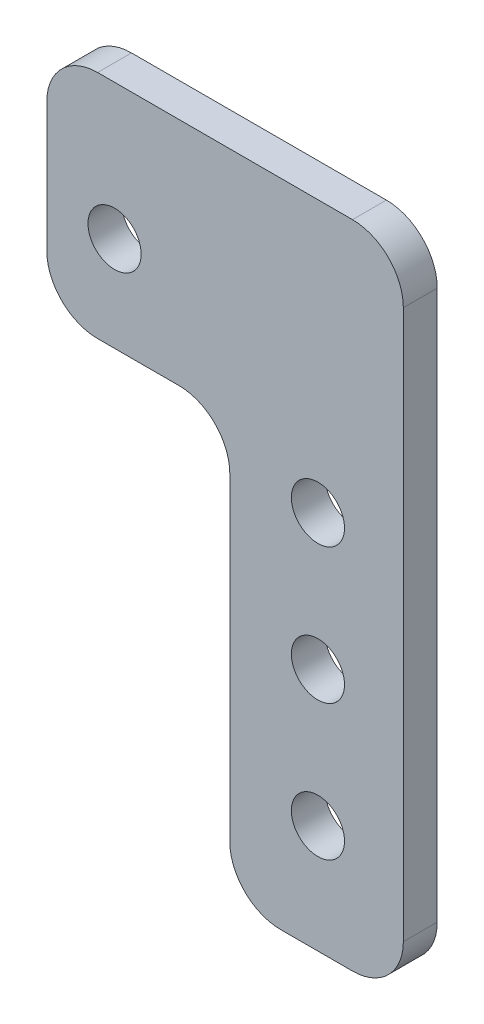
ISO-10303-21;
HEADER;
FILE_DESCRIPTION(('STEP AP214'),'2;1');
FILE_NAME('part.step','',(''),(''),'','','');
FILE_SCHEMA(('AUTOMOTIVE_DESIGN { 1 0 10303 214 1 1 1 1 }'));
ENDSEC;
DATA;
#1=APPLICATION_CONTEXT('core data for automotive mechanical design processes');
#2=APPLICATION_PROTOCOL_DEFINITION('international standard','automotive_design',2000,#1);
#3=PRODUCT_CONTEXT('',#1,'mechanical');
#4=PRODUCT('Part','Part','',(#3));
#5=PRODUCT_RELATED_PRODUCT_CATEGORY('part','',(#4));
#6=PRODUCT_DEFINITION_FORMATION('','',#4);
#7=PRODUCT_DEFINITION_CONTEXT('part definition',#1,'design');
#8=PRODUCT_DEFINITION('design','',#6,#7);
#9=PRODUCT_DEFINITION_SHAPE('','',#8);
#10=(LENGTH_UNIT() NAMED_UNIT(*) SI_UNIT(.MILLI.,.METRE.));
#11=(NAMED_UNIT(*) PLANE_ANGLE_UNIT() SI_UNIT($,.RADIAN.));
#12=(NAMED_UNIT(*) SI_UNIT($,.STERADIAN.) SOLID_ANGLE_UNIT());
#13=UNCERTAINTY_MEASURE_WITH_UNIT(LENGTH_MEASURE(1.E-05),#10,'distance_accuracy_value','');
#14=(GEOMETRIC_REPRESENTATION_CONTEXT(3) GLOBAL_UNCERTAINTY_ASSIGNED_CONTEXT((#13)) GLOBAL_UNIT_ASSIGNED_CONTEXT((#10,
#11,#12)) REPRESENTATION_CONTEXT('',''));
#15=CARTESIAN_POINT('',(0.,0.,0.));
#16=DIRECTION('',(0.,0.,1.));
#17=DIRECTION('',(1.,0.,0.));
#18=AXIS2_PLACEMENT_3D('',#15,#16,#17);
#19=CARTESIAN_POINT('',(0.,0.,3.175));
#20=DIRECTION('',(0.,0.,-1.));
#21=DIRECTION('',(-1.,0.,0.));
#22=AXIS2_PLACEMENT_3D('',#19,#20,#21);
#23=PLANE('',#22);
#24=DIRECTION('',(1.,0.,0.));
#25=VECTOR('',#24,1.);
#26=CARTESIAN_POINT('',(61.976,-63.5,3.175));
#27=LINE('',#26,#25);
#28=CARTESIAN_POINT('',(50.4825,-63.5,3.175));
#29=VERTEX_POINT('',#28);
#30=CARTESIAN_POINT('',(57.2135,-63.5,3.175));
#31=VERTEX_POINT('',#30);
#32=EDGE_CURVE('E161',#29,#31,#27,.T.);
#33=ORIENTED_EDGE('',*,*,#32,.T.);
#34=CARTESIAN_POINT('',(57.2135,-58.7375,3.175));
#35=DIRECTION('',(0.,0.,-1.));
#36=DIRECTION('',(-1.,0.,0.));
#37=AXIS2_PLACEMENT_3D('',#34,#35,#36);
#38=CIRCLE('',#37,4.7625);
#39=CARTESIAN_POINT('',(61.976,-58.7375,3.175));
#40=VERTEX_POINT('',#39);
#41=EDGE_CURVE('E191',#31,#40,#38,.F.);
#42=ORIENTED_EDGE('',*,*,#41,.T.);
#43=DIRECTION('',(0.,1.,0.));
#44=VECTOR('',#43,1.);
#45=CARTESIAN_POINT('',(61.976,-2.54,3.175));
#46=LINE('',#45,#44);
#47=CARTESIAN_POINT('',(61.976,-7.3025,3.175));
#48=VERTEX_POINT('',#47);
#49=EDGE_CURVE('E144',#40,#48,#46,.T.);
#50=ORIENTED_EDGE('',*,*,#49,.T.);
#51=CARTESIAN_POINT('',(57.2135,-7.3025,3.175));
#52=DIRECTION('',(0.,0.,-1.));
#53=DIRECTION('',(-1.,0.,0.));
#54=AXIS2_PLACEMENT_3D('',#51,#52,#53);
#55=CIRCLE('',#54,4.7625);
#56=CARTESIAN_POINT('',(57.2135,-2.54,3.175));
#57=VERTEX_POINT('',#56);
#58=EDGE_CURVE('E183',#48,#57,#55,.F.);
#59=ORIENTED_EDGE('',*,*,#58,.T.);
#60=DIRECTION('',(-1.,0.,0.));
#61=VECTOR('',#60,1.);
#62=CARTESIAN_POINT('',(28.575,-2.54,3.175));
#63=LINE('',#62,#61);
#64=CARTESIAN_POINT('',(33.3375,-2.54,3.175));
#65=VERTEX_POINT('',#64);
#66=EDGE_CURVE('E231',#57,#65,#63,.T.);
#67=ORIENTED_EDGE('',*,*,#66,.T.);
#68=CARTESIAN_POINT('',(33.3375,-7.3025,3.175));
#69=DIRECTION('',(0.,0.,-1.));
#70=DIRECTION('',(-1.,0.,0.));
#71=AXIS2_PLACEMENT_3D('',#68,#69,#70);
#72=CIRCLE('',#71,4.7625);
#73=CARTESIAN_POINT('',(28.575,-7.3025,3.175));
#74=VERTEX_POINT('',#73);
#75=EDGE_CURVE('E185',#65,#74,#72,.F.);
#76=ORIENTED_EDGE('',*,*,#75,.T.);
#77=DIRECTION('',(0.,-1.,0.));
#78=VECTOR('',#77,1.);
#79=CARTESIAN_POINT('',(28.575,-2.54,3.175));
#80=LINE('',#79,#78);
#81=CARTESIAN_POINT('',(28.575,-19.3675,3.175));
#82=VERTEX_POINT('',#81);
#83=EDGE_CURVE('E226',#74,#82,#80,.T.);
#84=ORIENTED_EDGE('',*,*,#83,.T.);
#85=CARTESIAN_POINT('',(33.3375,-19.3675,3.175));
#86=DIRECTION('',(0.,0.,-1.));
#87=DIRECTION('',(-1.,0.,0.));
#88=AXIS2_PLACEMENT_3D('',#85,#86,#87);
#89=CIRCLE('',#88,4.7625);
#90=CARTESIAN_POINT('',(33.3375,-24.13,3.175));
#91=VERTEX_POINT('',#90);
#92=EDGE_CURVE('E187',#82,#91,#89,.F.);
#93=ORIENTED_EDGE('',*,*,#92,.T.);
#94=DIRECTION('',(1.,0.,0.));
#95=VECTOR('',#94,1.);
#96=CARTESIAN_POINT('',(45.72,-24.13,3.175));
#97=LINE('',#96,#95);
#98=CARTESIAN_POINT('',(40.9575,-24.13,3.175));
#99=VERTEX_POINT('',#98);
#100=EDGE_CURVE('E224',#91,#99,#97,.T.);
#101=ORIENTED_EDGE('',*,*,#100,.T.);
#102=CARTESIAN_POINT('',(40.9575,-28.8925,3.175));
#103=DIRECTION('',(0.,0.,-1.));
#104=DIRECTION('',(-1.,0.,0.));
#105=AXIS2_PLACEMENT_3D('',#102,#103,#104);
#106=CIRCLE('',#105,4.7625);
#107=CARTESIAN_POINT('',(45.72,-28.8925,3.175));
#108=VERTEX_POINT('',#107);
#109=EDGE_CURVE('E11',#99,#108,#106,.T.);
#110=ORIENTED_EDGE('',*,*,#109,.T.);
#111=DIRECTION('',(0.,-1.,0.));
#112=VECTOR('',#111,1.);
#113=CARTESIAN_POINT('',(45.72,-63.5,3.175));
#114=LINE('',#113,#112);
#115=CARTESIAN_POINT('',(45.72,-58.7375,3.175));
#116=VERTEX_POINT('',#115);
#117=EDGE_CURVE('E222',#108,#116,#114,.T.);
#118=ORIENTED_EDGE('',*,*,#117,.T.);
#119=CARTESIAN_POINT('',(50.4825,-58.7375,3.175));
#120=DIRECTION('',(0.,0.,-1.));
#121=DIRECTION('',(-1.,0.,0.));
#122=AXIS2_PLACEMENT_3D('',#119,#120,#121);
#123=CIRCLE('',#122,4.7625);
#124=EDGE_CURVE('E189',#116,#29,#123,.F.);
#125=ORIENTED_EDGE('',*,*,#124,.T.);
#126=EDGE_LOOP('',(#33,#42,#50,#59,#67,#76,#84,#93,#101,#110,#118,#125));
#127=FACE_BOUND('',#126,.T.);
#128=CARTESIAN_POINT('',(53.9749999999999,-27.94,3.175));
#129=DIRECTION('',(0.,0.,1.));
#130=DIRECTION('',(1.,0.,0.));
#131=AXIS2_PLACEMENT_3D('',#128,#129,#130);
#132=CIRCLE('',#131,2.4892);
#133=CARTESIAN_POINT('',(56.4641999999999,-27.94,3.175));
#134=VERTEX_POINT('',#133);
#135=EDGE_CURVE('E152',#134,#134,#132,.T.);
#136=ORIENTED_EDGE('',*,*,#135,.F.);
#137=EDGE_LOOP('',(#136));
#138=FACE_BOUND('',#137,.T.);
#139=CARTESIAN_POINT('',(53.975,-40.64,3.175));
#140=DIRECTION('',(0.,0.,1.));
#141=DIRECTION('',(1.,0.,0.));
#142=AXIS2_PLACEMENT_3D('',#139,#140,#141);
#143=CIRCLE('',#142,2.4892);
#144=CARTESIAN_POINT('',(56.4642,-40.64,3.175));
#145=VERTEX_POINT('',#144);
#146=EDGE_CURVE('E236',#145,#145,#143,.T.);
#147=ORIENTED_EDGE('',*,*,#146,.F.);
#148=EDGE_LOOP('',(#147));
#149=FACE_BOUND('',#148,.T.);
#150=CARTESIAN_POINT('',(53.9750000000001,-53.34,3.175));
#151=DIRECTION('',(0.,0.,1.));
#152=DIRECTION('',(1.,0.,0.));
#153=AXIS2_PLACEMENT_3D('',#150,#151,#152);
#154=CIRCLE('',#153,2.4892);
#155=CARTESIAN_POINT('',(56.4642000000001,-53.34,3.175));
#156=VERTEX_POINT('',#155);
#157=EDGE_CURVE('E241',#156,#156,#154,.T.);
#158=ORIENTED_EDGE('',*,*,#157,.F.);
#159=EDGE_LOOP('',(#158));
#160=FACE_BOUND('',#159,.T.);
#161=CARTESIAN_POINT('',(34.925,-15.24,3.175));
#162=DIRECTION('',(0.,0.,1.));
#163=DIRECTION('',(1.,0.,0.));
#164=AXIS2_PLACEMENT_3D('',#161,#162,#163);
#165=CIRCLE('',#164,2.4892);
#166=CARTESIAN_POINT('',(37.4142,-15.24,3.175));
#167=VERTEX_POINT('',#166);
#168=EDGE_CURVE('E247',#167,#167,#165,.T.);
#169=ORIENTED_EDGE('',*,*,#168,.F.);
#170=EDGE_LOOP('',(#169));
#171=FACE_BOUND('',#170,.T.);
#172=ADVANCED_FACE('F35',(#127,#138,#149,#160,#171),#23,.F.);
#173=CARTESIAN_POINT('',(0.,0.,0.));
#174=DIRECTION('',(0.,0.,-1.));
#175=DIRECTION('',(-1.,0.,0.));
#176=AXIS2_PLACEMENT_3D('',#173,#174,#175);
#177=PLANE('',#176);
#178=CARTESIAN_POINT('',(53.9750000000001,-53.34,0.));
#179=DIRECTION('',(0.,0.,1.));
#180=DIRECTION('',(1.,0.,0.));
#181=AXIS2_PLACEMENT_3D('',#178,#179,#180);
#182=CIRCLE('',#181,2.4892);
#183=CARTESIAN_POINT('',(56.4642000000001,-53.34,0.));
#184=VERTEX_POINT('',#183);
#185=EDGE_CURVE('E244',#184,#184,#182,.T.);
#186=ORIENTED_EDGE('',*,*,#185,.T.);
#187=EDGE_LOOP('',(#186));
#188=FACE_BOUND('',#187,.T.);
#189=CARTESIAN_POINT('',(53.9749999999999,-27.94,0.));
#190=DIRECTION('',(0.,0.,1.));
#191=DIRECTION('',(1.,0.,0.));
#192=AXIS2_PLACEMENT_3D('',#189,#190,#191);
#193=CIRCLE('',#192,2.4892);
#194=CARTESIAN_POINT('',(56.4641999999999,-27.94,0.));
#195=VERTEX_POINT('',#194);
#196=EDGE_CURVE('E158',#195,#195,#193,.T.);
#197=ORIENTED_EDGE('',*,*,#196,.T.);
#198=EDGE_LOOP('',(#197));
#199=FACE_BOUND('',#198,.T.);
#200=DIRECTION('',(0.,1.,0.));
#201=VECTOR('',#200,1.);
#202=CARTESIAN_POINT('',(61.976,-2.54,0.));
#203=LINE('',#202,#201);
#204=CARTESIAN_POINT('',(61.976,-58.7375,0.));
#205=VERTEX_POINT('',#204);
#206=CARTESIAN_POINT('',(61.976,-7.3025,0.));
#207=VERTEX_POINT('',#206);
#208=EDGE_CURVE('E141',#205,#207,#203,.T.);
#209=ORIENTED_EDGE('',*,*,#208,.F.);
#210=CARTESIAN_POINT('',(57.2135,-58.7375,0.));
#211=DIRECTION('',(0.,0.,-1.));
#212=DIRECTION('',(-1.,0.,0.));
#213=AXIS2_PLACEMENT_3D('',#210,#211,#212);
#214=CIRCLE('',#213,4.7625);
#215=CARTESIAN_POINT('',(57.2135,-63.5,0.));
#216=VERTEX_POINT('',#215);
#217=EDGE_CURVE('E124',#205,#216,#214,.T.);
#218=ORIENTED_EDGE('',*,*,#217,.T.);
#219=DIRECTION('',(1.,0.,0.));
#220=VECTOR('',#219,1.);
#221=CARTESIAN_POINT('',(61.976,-63.5,0.));
#222=LINE('',#221,#220);
#223=CARTESIAN_POINT('',(50.4825,-63.5,0.));
#224=VERTEX_POINT('',#223);
#225=EDGE_CURVE('E171',#224,#216,#222,.T.);
#226=ORIENTED_EDGE('',*,*,#225,.F.);
#227=CARTESIAN_POINT('',(50.4825,-58.7375,0.));
#228=DIRECTION('',(0.,0.,-1.));
#229=DIRECTION('',(-1.,0.,0.));
#230=AXIS2_PLACEMENT_3D('',#227,#228,#229);
#231=CIRCLE('',#230,4.7625);
#232=CARTESIAN_POINT('',(45.72,-58.7375,0.));
#233=VERTEX_POINT('',#232);
#234=EDGE_CURVE('E135',#224,#233,#231,.T.);
#235=ORIENTED_EDGE('',*,*,#234,.T.);
#236=DIRECTION('',(0.,-1.,0.));
#237=VECTOR('',#236,1.);
#238=CARTESIAN_POINT('',(45.72,-63.5,0.));
#239=LINE('',#238,#237);
#240=CARTESIAN_POINT('',(45.72,-28.8925,0.));
#241=VERTEX_POINT('',#240);
#242=EDGE_CURVE('E169',#241,#233,#239,.T.);
#243=ORIENTED_EDGE('',*,*,#242,.F.);
#244=CARTESIAN_POINT('',(40.9575,-28.8925,0.));
#245=DIRECTION('',(0.,0.,-1.));
#246=DIRECTION('',(-1.,0.,0.));
#247=AXIS2_PLACEMENT_3D('',#244,#245,#246);
#248=CIRCLE('',#247,4.7625);
#249=CARTESIAN_POINT('',(40.9575,-24.13,0.));
#250=VERTEX_POINT('',#249);
#251=EDGE_CURVE('E43',#241,#250,#248,.F.);
#252=ORIENTED_EDGE('',*,*,#251,.T.);
#253=DIRECTION('',(1.,0.,0.));
#254=VECTOR('',#253,1.);
#255=CARTESIAN_POINT('',(45.72,-24.13,0.));
#256=LINE('',#255,#254);
#257=CARTESIAN_POINT('',(33.3375,-24.13,0.));
#258=VERTEX_POINT('',#257);
#259=EDGE_CURVE('E166',#258,#250,#256,.T.);
#260=ORIENTED_EDGE('',*,*,#259,.F.);
#261=CARTESIAN_POINT('',(33.3375,-19.3675,0.));
#262=DIRECTION('',(0.,0.,-1.));
#263=DIRECTION('',(-1.,0.,0.));
#264=AXIS2_PLACEMENT_3D('',#261,#262,#263);
#265=CIRCLE('',#264,4.7625);
#266=CARTESIAN_POINT('',(28.575,-19.3675,0.));
#267=VERTEX_POINT('',#266);
#268=EDGE_CURVE('E177',#258,#267,#265,.T.);
#269=ORIENTED_EDGE('',*,*,#268,.T.);
#270=DIRECTION('',(0.,-1.,0.));
#271=VECTOR('',#270,1.);
#272=CARTESIAN_POINT('',(28.575,-2.54,0.));
#273=LINE('',#272,#271);
#274=CARTESIAN_POINT('',(28.575,-7.3025,0.));
#275=VERTEX_POINT('',#274);
#276=EDGE_CURVE('E155',#275,#267,#273,.T.);
#277=ORIENTED_EDGE('',*,*,#276,.F.);
#278=CARTESIAN_POINT('',(33.3375,-7.3025,0.));
#279=DIRECTION('',(0.,0.,-1.));
#280=DIRECTION('',(-1.,0.,0.));
#281=AXIS2_PLACEMENT_3D('',#278,#279,#280);
#282=CIRCLE('',#281,4.7625);
#283=CARTESIAN_POINT('',(33.3375,-2.54,0.));
#284=VERTEX_POINT('',#283);
#285=EDGE_CURVE('E175',#275,#284,#282,.T.);
#286=ORIENTED_EDGE('',*,*,#285,.T.);
#287=DIRECTION('',(-1.,0.,0.));
#288=VECTOR('',#287,1.);
#289=CARTESIAN_POINT('',(28.575,-2.54,0.));
#290=LINE('',#289,#288);
#291=CARTESIAN_POINT('',(57.2135,-2.54,0.));
#292=VERTEX_POINT('',#291);
#293=EDGE_CURVE('E151',#292,#284,#290,.T.);
#294=ORIENTED_EDGE('',*,*,#293,.F.);
#295=CARTESIAN_POINT('',(57.2135,-7.3025,0.));
#296=DIRECTION('',(0.,0.,-1.));
#297=DIRECTION('',(-1.,0.,0.));
#298=AXIS2_PLACEMENT_3D('',#295,#296,#297);
#299=CIRCLE('',#298,4.7625);
#300=EDGE_CURVE('E145',#292,#207,#299,.T.);
#301=ORIENTED_EDGE('',*,*,#300,.T.);
#302=EDGE_LOOP('',(#209,#218,#226,#235,#243,#252,#260,#269,#277,#286,#294,#301));
#303=FACE_BOUND('',#302,.T.);
#304=CARTESIAN_POINT('',(53.975,-40.64,0.));
#305=DIRECTION('',(0.,0.,1.));
#306=DIRECTION('',(1.,0.,0.));
#307=AXIS2_PLACEMENT_3D('',#304,#305,#306);
#308=CIRCLE('',#307,2.4892);
#309=CARTESIAN_POINT('',(56.4642,-40.64,0.));
#310=VERTEX_POINT('',#309);
#311=EDGE_CURVE('E238',#310,#310,#308,.T.);
#312=ORIENTED_EDGE('',*,*,#311,.T.);
#313=EDGE_LOOP('',(#312));
#314=FACE_BOUND('',#313,.T.);
#315=CARTESIAN_POINT('',(34.925,-15.24,0.));
#316=DIRECTION('',(0.,0.,1.));
#317=DIRECTION('',(1.,0.,0.));
#318=AXIS2_PLACEMENT_3D('',#315,#316,#317);
#319=CIRCLE('',#318,2.4892);
#320=CARTESIAN_POINT('',(37.4142,-15.24,0.));
#321=VERTEX_POINT('',#320);
#322=EDGE_CURVE('E250',#321,#321,#319,.T.);
#323=ORIENTED_EDGE('',*,*,#322,.T.);
#324=EDGE_LOOP('',(#323));
#325=FACE_BOUND('',#324,.T.);
#326=ADVANCED_FACE('F148',(#188,#199,#303,#314,#325),#177,.T.);
#327=CARTESIAN_POINT('',(61.976,-2.54,3.175));
#328=DIRECTION('',(-1.,0.,0.));
#329=DIRECTION('',(0.,-1.,0.));
#330=AXIS2_PLACEMENT_3D('',#327,#328,#329);
#331=PLANE('',#330);
#332=ORIENTED_EDGE('',*,*,#49,.F.);
#333=DIRECTION('',(0.,0.,-1.));
#334=VECTOR('',#333,1.);
#335=CARTESIAN_POINT('',(61.976,-58.7375,3.175));
#336=LINE('',#335,#334);
#337=EDGE_CURVE('E128',#40,#205,#336,.T.);
#338=ORIENTED_EDGE('',*,*,#337,.T.);
#339=ORIENTED_EDGE('',*,*,#208,.T.);
#340=DIRECTION('',(0.,0.,-1.));
#341=VECTOR('',#340,1.);
#342=CARTESIAN_POINT('',(61.976,-7.3025,3.175));
#343=LINE('',#342,#341);
#344=EDGE_CURVE('E146',#207,#48,#343,.F.);
#345=ORIENTED_EDGE('',*,*,#344,.T.);
#346=EDGE_LOOP('',(#332,#338,#339,#345));
#347=FACE_BOUND('',#346,.T.);
#348=ADVANCED_FACE('F140',(#347),#331,.F.);
#349=CARTESIAN_POINT('',(28.575,-2.54,3.175));
#350=DIRECTION('',(0.,-1.,0.));
#351=DIRECTION('',(0.,0.,-1.));
#352=AXIS2_PLACEMENT_3D('',#349,#350,#351);
#353=PLANE('',#352);
#354=ORIENTED_EDGE('',*,*,#293,.T.);
#355=DIRECTION('',(0.,0.,-1.));
#356=VECTOR('',#355,1.);
#357=CARTESIAN_POINT('',(33.3375,-2.54,3.175));
#358=LINE('',#357,#356);
#359=EDGE_CURVE('E210',#284,#65,#358,.F.);
#360=ORIENTED_EDGE('',*,*,#359,.T.);
#361=ORIENTED_EDGE('',*,*,#66,.F.);
#362=DIRECTION('',(0.,0.,-1.));
#363=VECTOR('',#362,1.);
#364=CARTESIAN_POINT('',(57.2135,-2.54,3.175));
#365=LINE('',#364,#363);
#366=EDGE_CURVE('E207',#57,#292,#365,.T.);
#367=ORIENTED_EDGE('',*,*,#366,.T.);
#368=EDGE_LOOP('',(#354,#360,#361,#367));
#369=FACE_BOUND('',#368,.T.);
#370=ADVANCED_FACE('F282',(#369),#353,.F.);
#371=CARTESIAN_POINT('',(28.575,-2.54,3.175));
#372=DIRECTION('',(1.,0.,0.));
#373=DIRECTION('',(0.,1.,0.));
#374=AXIS2_PLACEMENT_3D('',#371,#372,#373);
#375=PLANE('',#374);
#376=ORIENTED_EDGE('',*,*,#276,.T.);
#377=DIRECTION('',(0.,0.,-1.));
#378=VECTOR('',#377,1.);
#379=CARTESIAN_POINT('',(28.575,-19.3675,3.175));
#380=LINE('',#379,#378);
#381=EDGE_CURVE('E205',#267,#82,#380,.F.);
#382=ORIENTED_EDGE('',*,*,#381,.T.);
#383=ORIENTED_EDGE('',*,*,#83,.F.);
#384=DIRECTION('',(0.,0.,-1.));
#385=VECTOR('',#384,1.);
#386=CARTESIAN_POINT('',(28.575,-7.3025,3.175));
#387=LINE('',#386,#385);
#388=EDGE_CURVE('E202',#74,#275,#387,.T.);
#389=ORIENTED_EDGE('',*,*,#388,.T.);
#390=EDGE_LOOP('',(#376,#382,#383,#389));
#391=FACE_BOUND('',#390,.T.);
#392=ADVANCED_FACE('F279',(#391),#375,.F.);
#393=CARTESIAN_POINT('',(45.72,-24.13,3.175));
#394=DIRECTION('',(0.,1.,0.));
#395=DIRECTION('',(0.,0.,1.));
#396=AXIS2_PLACEMENT_3D('',#393,#394,#395);
#397=PLANE('',#396);
#398=ORIENTED_EDGE('',*,*,#259,.T.);
#399=DIRECTION('',(0.,0.,-1.));
#400=VECTOR('',#399,1.);
#401=CARTESIAN_POINT('',(40.9575,-24.13,3.175));
#402=LINE('',#401,#400);
#403=EDGE_CURVE('E200',#250,#99,#402,.F.);
#404=ORIENTED_EDGE('',*,*,#403,.T.);
#405=ORIENTED_EDGE('',*,*,#100,.F.);
#406=DIRECTION('',(0.,0.,-1.));
#407=VECTOR('',#406,1.);
#408=CARTESIAN_POINT('',(33.3375,-24.13,3.175));
#409=LINE('',#408,#407);
#410=EDGE_CURVE('E197',#91,#258,#409,.T.);
#411=ORIENTED_EDGE('',*,*,#410,.T.);
#412=EDGE_LOOP('',(#398,#404,#405,#411));
#413=FACE_BOUND('',#412,.T.);
#414=ADVANCED_FACE('F217',(#413),#397,.F.);
#415=CARTESIAN_POINT('',(45.72,-63.5,3.175));
#416=DIRECTION('',(1.,0.,0.));
#417=DIRECTION('',(0.,0.,-1.));
#418=AXIS2_PLACEMENT_3D('',#415,#416,#417);
#419=PLANE('',#418);
#420=ORIENTED_EDGE('',*,*,#242,.T.);
#421=DIRECTION('',(0.,0.,-1.));
#422=VECTOR('',#421,1.);
#423=CARTESIAN_POINT('',(45.72,-58.7375,3.175));
#424=LINE('',#423,#422);
#425=EDGE_CURVE('E50',#233,#116,#424,.F.);
#426=ORIENTED_EDGE('',*,*,#425,.T.);
#427=ORIENTED_EDGE('',*,*,#117,.F.);
#428=DIRECTION('',(0.,0.,-1.));
#429=VECTOR('',#428,1.);
#430=CARTESIAN_POINT('',(45.72,-28.8925,0.));
#431=LINE('',#430,#429);
#432=EDGE_CURVE('E193',#108,#241,#431,.T.);
#433=ORIENTED_EDGE('',*,*,#432,.T.);
#434=EDGE_LOOP('',(#420,#426,#427,#433));
#435=FACE_BOUND('',#434,.T.);
#436=ADVANCED_FACE('F221',(#435),#419,.F.);
#437=CARTESIAN_POINT('',(61.976,-63.5,3.175));
#438=DIRECTION('',(0.,1.,0.));
#439=DIRECTION('',(0.,0.,1.));
#440=AXIS2_PLACEMENT_3D('',#437,#438,#439);
#441=PLANE('',#440);
#442=ORIENTED_EDGE('',*,*,#225,.T.);
#443=DIRECTION('',(0.,0.,-1.));
#444=VECTOR('',#443,1.);
#445=CARTESIAN_POINT('',(57.2135,-63.5,3.175));
#446=LINE('',#445,#444);
#447=EDGE_CURVE('E129',#216,#31,#446,.F.);
#448=ORIENTED_EDGE('',*,*,#447,.T.);
#449=ORIENTED_EDGE('',*,*,#32,.F.);
#450=DIRECTION('',(0.,0.,-1.));
#451=VECTOR('',#450,1.);
#452=CARTESIAN_POINT('',(50.4825,-63.5,3.175));
#453=LINE('',#452,#451);
#454=EDGE_CURVE('E134',#29,#224,#453,.T.);
#455=ORIENTED_EDGE('',*,*,#454,.T.);
#456=EDGE_LOOP('',(#442,#448,#449,#455));
#457=FACE_BOUND('',#456,.T.);
#458=ADVANCED_FACE('F271',(#457),#441,.F.);
#459=CARTESIAN_POINT('',(53.9749999999999,-27.94,3.175));
#460=DIRECTION('',(0.,0.,-1.));
#461=DIRECTION('',(-1.,0.,0.));
#462=AXIS2_PLACEMENT_3D('',#459,#460,#461);
#463=CYLINDRICAL_SURFACE('',#462,2.4892);
#464=ORIENTED_EDGE('',*,*,#135,.T.);
#465=EDGE_LOOP('',(#464));
#466=FACE_BOUND('',#465,.T.);
#467=ORIENTED_EDGE('',*,*,#196,.F.);
#468=EDGE_LOOP('',(#467));
#469=FACE_BOUND('',#468,.T.);
#470=ADVANCED_FACE('F268',(#466,#469),#463,.F.);
#471=CARTESIAN_POINT('',(53.975,-40.64,3.175));
#472=DIRECTION('',(0.,0.,-1.));
#473=DIRECTION('',(-1.,0.,0.));
#474=AXIS2_PLACEMENT_3D('',#471,#472,#473);
#475=CYLINDRICAL_SURFACE('',#474,2.4892);
#476=ORIENTED_EDGE('',*,*,#146,.T.);
#477=EDGE_LOOP('',(#476));
#478=FACE_BOUND('',#477,.T.);
#479=ORIENTED_EDGE('',*,*,#311,.F.);
#480=EDGE_LOOP('',(#479));
#481=FACE_BOUND('',#480,.T.);
#482=ADVANCED_FACE('F415',(#478,#481),#475,.F.);
#483=CARTESIAN_POINT('',(53.9750000000001,-53.34,3.175));
#484=DIRECTION('',(0.,0.,-1.));
#485=DIRECTION('',(-1.,0.,0.));
#486=AXIS2_PLACEMENT_3D('',#483,#484,#485);
#487=CYLINDRICAL_SURFACE('',#486,2.4892);
#488=ORIENTED_EDGE('',*,*,#157,.T.);
#489=EDGE_LOOP('',(#488));
#490=FACE_BOUND('',#489,.T.);
#491=ORIENTED_EDGE('',*,*,#185,.F.);
#492=EDGE_LOOP('',(#491));
#493=FACE_BOUND('',#492,.T.);
#494=ADVANCED_FACE('F406',(#490,#493),#487,.F.);
#495=CARTESIAN_POINT('',(34.925,-15.24,3.175));
#496=DIRECTION('',(0.,0.,-1.));
#497=DIRECTION('',(-1.,0.,0.));
#498=AXIS2_PLACEMENT_3D('',#495,#496,#497);
#499=CYLINDRICAL_SURFACE('',#498,2.4892);
#500=ORIENTED_EDGE('',*,*,#168,.T.);
#501=EDGE_LOOP('',(#500));
#502=FACE_BOUND('',#501,.T.);
#503=ORIENTED_EDGE('',*,*,#322,.F.);
#504=EDGE_LOOP('',(#503));
#505=FACE_BOUND('',#504,.T.);
#506=ADVANCED_FACE('F256',(#502,#505),#499,.F.);
#507=CARTESIAN_POINT('',(57.2135,-58.7375,3.175));
#508=DIRECTION('',(0.,0.,-1.));
#509=DIRECTION('',(-1.,0.,0.));
#510=AXIS2_PLACEMENT_3D('',#507,#508,#509);
#511=CYLINDRICAL_SURFACE('',#510,4.7625);
#512=ORIENTED_EDGE('',*,*,#41,.F.);
#513=ORIENTED_EDGE('',*,*,#447,.F.);
#514=ORIENTED_EDGE('',*,*,#217,.F.);
#515=ORIENTED_EDGE('',*,*,#337,.F.);
#516=EDGE_LOOP('',(#512,#513,#514,#515));
#517=FACE_BOUND('',#516,.T.);
#518=ADVANCED_FACE('F127',(#517),#511,.T.);
#519=CARTESIAN_POINT('',(50.4825,-58.7375,3.175));
#520=DIRECTION('',(0.,0.,-1.));
#521=DIRECTION('',(-1.,0.,0.));
#522=AXIS2_PLACEMENT_3D('',#519,#520,#521);
#523=CYLINDRICAL_SURFACE('',#522,4.7625);
#524=ORIENTED_EDGE('',*,*,#124,.F.);
#525=ORIENTED_EDGE('',*,*,#425,.F.);
#526=ORIENTED_EDGE('',*,*,#234,.F.);
#527=ORIENTED_EDGE('',*,*,#454,.F.);
#528=EDGE_LOOP('',(#524,#525,#526,#527));
#529=FACE_BOUND('',#528,.T.);
#530=ADVANCED_FACE('F291',(#529),#523,.T.);
#531=CARTESIAN_POINT('',(40.9575,-28.8925,3.175));
#532=DIRECTION('',(0.,0.,1.));
#533=DIRECTION('',(1.,0.,0.));
#534=AXIS2_PLACEMENT_3D('',#531,#532,#533);
#535=CYLINDRICAL_SURFACE('',#534,4.7625);
#536=ORIENTED_EDGE('',*,*,#109,.F.);
#537=ORIENTED_EDGE('',*,*,#403,.F.);
#538=ORIENTED_EDGE('',*,*,#251,.F.);
#539=ORIENTED_EDGE('',*,*,#432,.F.);
#540=EDGE_LOOP('',(#536,#537,#538,#539));
#541=FACE_BOUND('',#540,.T.);
#542=ADVANCED_FACE('F220',(#541),#535,.F.);
#543=CARTESIAN_POINT('',(33.3375,-19.3675,3.175));
#544=DIRECTION('',(0.,0.,-1.));
#545=DIRECTION('',(-1.,0.,0.));
#546=AXIS2_PLACEMENT_3D('',#543,#544,#545);
#547=CYLINDRICAL_SURFACE('',#546,4.7625);
#548=ORIENTED_EDGE('',*,*,#92,.F.);
#549=ORIENTED_EDGE('',*,*,#381,.F.);
#550=ORIENTED_EDGE('',*,*,#268,.F.);
#551=ORIENTED_EDGE('',*,*,#410,.F.);
#552=EDGE_LOOP('',(#548,#549,#550,#551));
#553=FACE_BOUND('',#552,.T.);
#554=ADVANCED_FACE('F297',(#553),#547,.T.);
#555=CARTESIAN_POINT('',(33.3375,-7.3025,3.175));
#556=DIRECTION('',(0.,0.,-1.));
#557=DIRECTION('',(-1.,0.,0.));
#558=AXIS2_PLACEMENT_3D('',#555,#556,#557);
#559=CYLINDRICAL_SURFACE('',#558,4.7625);
#560=ORIENTED_EDGE('',*,*,#75,.F.);
#561=ORIENTED_EDGE('',*,*,#359,.F.);
#562=ORIENTED_EDGE('',*,*,#285,.F.);
#563=ORIENTED_EDGE('',*,*,#388,.F.);
#564=EDGE_LOOP('',(#560,#561,#562,#563));
#565=FACE_BOUND('',#564,.T.);
#566=ADVANCED_FACE('F299',(#565),#559,.T.);
#567=CARTESIAN_POINT('',(57.2135,-7.3025,3.175));
#568=DIRECTION('',(0.,0.,-1.));
#569=DIRECTION('',(-1.,0.,0.));
#570=AXIS2_PLACEMENT_3D('',#567,#568,#569);
#571=CYLINDRICAL_SURFACE('',#570,4.7625);
#572=ORIENTED_EDGE('',*,*,#58,.F.);
#573=ORIENTED_EDGE('',*,*,#344,.F.);
#574=ORIENTED_EDGE('',*,*,#300,.F.);
#575=ORIENTED_EDGE('',*,*,#366,.F.);
#576=EDGE_LOOP('',(#572,#573,#574,#575));
#577=FACE_BOUND('',#576,.T.);
#578=ADVANCED_FACE('F37',(#577),#571,.T.);
#579=CLOSED_SHELL('',(#172,#326,#348,#370,#392,#414,#436,#458,#470,#482,#494,#506,#518,#530,
#542,#554,#566,#578));
#580=MANIFOLD_SOLID_BREP('B2',#579);
#581=ADVANCED_BREP_SHAPE_REPRESENTATION('',(#18,#580),#14);
#582=SHAPE_DEFINITION_REPRESENTATION(#9,#581);
ENDSEC;
END-ISO-10303-21;
